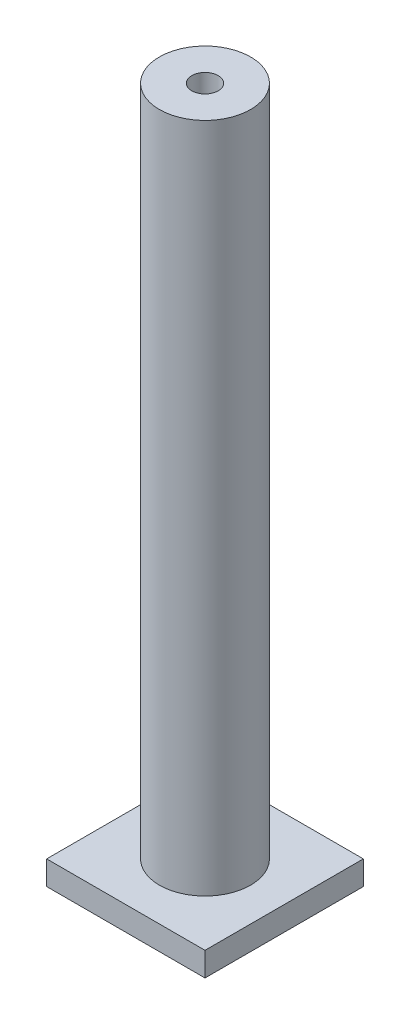
ISO-10303-21;
HEADER;
FILE_DESCRIPTION(('STEP AP214'),'2;1');
FILE_NAME('part.step','',(''),(''),'','','');
FILE_SCHEMA(('AUTOMOTIVE_DESIGN { 1 0 10303 214 1 1 1 1 }'));
ENDSEC;
DATA;
#1=APPLICATION_CONTEXT('core data for automotive mechanical design processes');
#2=APPLICATION_PROTOCOL_DEFINITION('international standard','automotive_design',2000,#1);
#3=PRODUCT_CONTEXT('',#1,'mechanical');
#4=PRODUCT('Part','Part','',(#3));
#5=PRODUCT_RELATED_PRODUCT_CATEGORY('part','',(#4));
#6=PRODUCT_DEFINITION_FORMATION('','',#4);
#7=PRODUCT_DEFINITION_CONTEXT('part definition',#1,'design');
#8=PRODUCT_DEFINITION('design','',#6,#7);
#9=PRODUCT_DEFINITION_SHAPE('','',#8);
#10=(LENGTH_UNIT() NAMED_UNIT(*) SI_UNIT(.MILLI.,.METRE.));
#11=(NAMED_UNIT(*) PLANE_ANGLE_UNIT() SI_UNIT($,.RADIAN.));
#12=(NAMED_UNIT(*) SI_UNIT($,.STERADIAN.) SOLID_ANGLE_UNIT());
#13=UNCERTAINTY_MEASURE_WITH_UNIT(LENGTH_MEASURE(1.E-05),#10,'distance_accuracy_value','');
#14=(GEOMETRIC_REPRESENTATION_CONTEXT(3) GLOBAL_UNCERTAINTY_ASSIGNED_CONTEXT((#13)) GLOBAL_UNIT_ASSIGNED_CONTEXT((#10,
#11,#12)) REPRESENTATION_CONTEXT('',''));
#15=CARTESIAN_POINT('',(0.,0.,0.));
#16=DIRECTION('',(0.,0.,1.));
#17=DIRECTION('',(1.,0.,0.));
#18=AXIS2_PLACEMENT_3D('',#15,#16,#17);
#19=CARTESIAN_POINT('',(0.,2.5,0.));
#20=DIRECTION('',(0.,1.,0.));
#21=DIRECTION('',(0.,0.,1.));
#22=AXIS2_PLACEMENT_3D('',#19,#20,#21);
#23=PLANE('',#22);
#24=DIRECTION('',(0.,0.,1.));
#25=VECTOR('',#24,1.);
#26=CARTESIAN_POINT('',(-7.79447852760735,2.5,-6.83282208588957));
#27=LINE('',#26,#25);
#28=CARTESIAN_POINT('',(-7.79447852760735,2.5,-6.83282208588957));
#29=VERTEX_POINT('',#28);
#30=CARTESIAN_POINT('',(-7.79447852760735,2.5,9.66717791411043));
#31=VERTEX_POINT('',#30);
#32=EDGE_CURVE('E87',#29,#31,#27,.T.);
#33=ORIENTED_EDGE('',*,*,#32,.T.);
#34=DIRECTION('',(1.,0.,0.));
#35=VECTOR('',#34,1.);
#36=CARTESIAN_POINT('',(-7.79447852760735,2.5,9.66717791411043));
#37=LINE('',#36,#35);
#38=CARTESIAN_POINT('',(8.70552147239265,2.5,9.66717791411043));
#39=VERTEX_POINT('',#38);
#40=EDGE_CURVE('E82',#31,#39,#37,.T.);
#41=ORIENTED_EDGE('',*,*,#40,.T.);
#42=DIRECTION('',(0.,0.,-1.));
#43=VECTOR('',#42,1.);
#44=CARTESIAN_POINT('',(8.70552147239265,2.5,-6.83282208588958));
#45=LINE('',#44,#43);
#46=CARTESIAN_POINT('',(8.70552147239265,2.5,-6.83282208588958));
#47=VERTEX_POINT('',#46);
#48=EDGE_CURVE('E85',#39,#47,#45,.T.);
#49=ORIENTED_EDGE('',*,*,#48,.T.);
#50=DIRECTION('',(-1.,0.,0.));
#51=VECTOR('',#50,1.);
#52=CARTESIAN_POINT('',(-7.79447852760735,2.5,-6.83282208588957));
#53=LINE('',#52,#51);
#54=EDGE_CURVE('E52',#47,#29,#53,.T.);
#55=ORIENTED_EDGE('',*,*,#54,.T.);
#56=EDGE_LOOP('',(#33,#41,#49,#55));
#57=FACE_BOUND('',#56,.T.);
#58=CARTESIAN_POINT('',(0.455521472392649,2.5,1.41717791411042));
#59=DIRECTION('',(0.,1.,0.));
#60=DIRECTION('',(0.,0.,1.));
#61=AXIS2_PLACEMENT_3D('',#58,#59,#60);
#62=CIRCLE('',#61,4.75);
#63=CARTESIAN_POINT('',(0.455521472392649,2.5,6.16717791411042));
#64=VERTEX_POINT('',#63);
#65=EDGE_CURVE('E117',#64,#64,#62,.T.);
#66=ORIENTED_EDGE('',*,*,#65,.F.);
#67=EDGE_LOOP('',(#66));
#68=FACE_BOUND('',#67,.T.);
#69=ADVANCED_FACE('F35',(#57,#68),#23,.T.);
#70=CARTESIAN_POINT('',(0.,0.,0.));
#71=DIRECTION('',(0.,1.,0.));
#72=DIRECTION('',(0.,0.,1.));
#73=AXIS2_PLACEMENT_3D('',#70,#71,#72);
#74=PLANE('',#73);
#75=DIRECTION('',(0.,0.,1.));
#76=VECTOR('',#75,1.);
#77=CARTESIAN_POINT('',(-7.79447852760735,0.,-6.83282208588957));
#78=LINE('',#77,#76);
#79=CARTESIAN_POINT('',(-7.79447852760735,0.,-6.83282208588957));
#80=VERTEX_POINT('',#79);
#81=CARTESIAN_POINT('',(-7.79447852760735,0.,9.66717791411043));
#82=VERTEX_POINT('',#81);
#83=EDGE_CURVE('E99',#80,#82,#78,.T.);
#84=ORIENTED_EDGE('',*,*,#83,.F.);
#85=DIRECTION('',(-1.,0.,0.));
#86=VECTOR('',#85,1.);
#87=CARTESIAN_POINT('',(-7.79447852760735,0.,-6.83282208588957));
#88=LINE('',#87,#86);
#89=CARTESIAN_POINT('',(8.70552147239265,0.,-6.83282208588958));
#90=VERTEX_POINT('',#89);
#91=EDGE_CURVE('E75',#90,#80,#88,.T.);
#92=ORIENTED_EDGE('',*,*,#91,.F.);
#93=DIRECTION('',(0.,0.,-1.));
#94=VECTOR('',#93,1.);
#95=CARTESIAN_POINT('',(8.70552147239265,0.,-6.83282208588958));
#96=LINE('',#95,#94);
#97=CARTESIAN_POINT('',(8.70552147239265,0.,9.66717791411043));
#98=VERTEX_POINT('',#97);
#99=EDGE_CURVE('E69',#98,#90,#96,.T.);
#100=ORIENTED_EDGE('',*,*,#99,.F.);
#101=DIRECTION('',(1.,0.,0.));
#102=VECTOR('',#101,1.);
#103=CARTESIAN_POINT('',(-7.79447852760735,0.,9.66717791411043));
#104=LINE('',#103,#102);
#105=EDGE_CURVE('E91',#82,#98,#104,.T.);
#106=ORIENTED_EDGE('',*,*,#105,.F.);
#107=EDGE_LOOP('',(#84,#92,#100,#106));
#108=FACE_BOUND('',#107,.T.);
#109=CARTESIAN_POINT('',(0.455521472392649,0.,1.41717791411042));
#110=DIRECTION('',(0.,1.,0.));
#111=DIRECTION('',(0.,0.,1.));
#112=AXIS2_PLACEMENT_3D('',#109,#110,#111);
#113=CIRCLE('',#112,1.375);
#114=CARTESIAN_POINT('',(0.455521472392649,0.,2.79217791411042));
#115=VERTEX_POINT('',#114);
#116=EDGE_CURVE('E102',#115,#115,#113,.T.);
#117=ORIENTED_EDGE('',*,*,#116,.T.);
#118=EDGE_LOOP('',(#117));
#119=FACE_BOUND('',#118,.T.);
#120=ADVANCED_FACE('F110',(#108,#119),#74,.F.);
#121=CARTESIAN_POINT('',(-7.79447852760735,2.5,-6.83282208588957));
#122=DIRECTION('',(1.,0.,0.));
#123=DIRECTION('',(0.,0.,-1.));
#124=AXIS2_PLACEMENT_3D('',#121,#122,#123);
#125=PLANE('',#124);
#126=ORIENTED_EDGE('',*,*,#83,.T.);
#127=DIRECTION('',(0.,-1.,0.));
#128=VECTOR('',#127,1.);
#129=CARTESIAN_POINT('',(-7.79447852760735,2.5,9.66717791411043));
#130=LINE('',#129,#128);
#131=EDGE_CURVE('E11',#31,#82,#130,.T.);
#132=ORIENTED_EDGE('',*,*,#131,.F.);
#133=ORIENTED_EDGE('',*,*,#32,.F.);
#134=DIRECTION('',(0.,-1.,0.));
#135=VECTOR('',#134,1.);
#136=CARTESIAN_POINT('',(-7.79447852760735,2.5,-6.83282208588957));
#137=LINE('',#136,#135);
#138=EDGE_CURVE('E95',#29,#80,#137,.T.);
#139=ORIENTED_EDGE('',*,*,#138,.T.);
#140=EDGE_LOOP('',(#126,#132,#133,#139));
#141=FACE_BOUND('',#140,.T.);
#142=ADVANCED_FACE('F37',(#141),#125,.F.);
#143=CARTESIAN_POINT('',(-7.79447852760735,2.5,9.66717791411043));
#144=DIRECTION('',(0.,0.,-1.));
#145=DIRECTION('',(-1.,0.,0.));
#146=AXIS2_PLACEMENT_3D('',#143,#144,#145);
#147=PLANE('',#146);
#148=ORIENTED_EDGE('',*,*,#105,.T.);
#149=DIRECTION('',(0.,-1.,0.));
#150=VECTOR('',#149,1.);
#151=CARTESIAN_POINT('',(8.70552147239265,2.5,9.66717791411043));
#152=LINE('',#151,#150);
#153=EDGE_CURVE('E44',#39,#98,#152,.T.);
#154=ORIENTED_EDGE('',*,*,#153,.F.);
#155=ORIENTED_EDGE('',*,*,#40,.F.);
#156=ORIENTED_EDGE('',*,*,#131,.T.);
#157=EDGE_LOOP('',(#148,#154,#155,#156));
#158=FACE_BOUND('',#157,.T.);
#159=ADVANCED_FACE('F90',(#158),#147,.F.);
#160=CARTESIAN_POINT('',(8.70552147239265,2.5,-6.83282208588958));
#161=DIRECTION('',(-1.,0.,0.));
#162=DIRECTION('',(0.,0.,1.));
#163=AXIS2_PLACEMENT_3D('',#160,#161,#162);
#164=PLANE('',#163);
#165=ORIENTED_EDGE('',*,*,#99,.T.);
#166=DIRECTION('',(0.,-1.,0.));
#167=VECTOR('',#166,1.);
#168=CARTESIAN_POINT('',(8.70552147239265,2.5,-6.83282208588958));
#169=LINE('',#168,#167);
#170=EDGE_CURVE('E92',#47,#90,#169,.T.);
#171=ORIENTED_EDGE('',*,*,#170,.F.);
#172=ORIENTED_EDGE('',*,*,#48,.F.);
#173=ORIENTED_EDGE('',*,*,#153,.T.);
#174=EDGE_LOOP('',(#165,#171,#172,#173));
#175=FACE_BOUND('',#174,.T.);
#176=ADVANCED_FACE('F93',(#175),#164,.F.);
#177=CARTESIAN_POINT('',(-7.79447852760735,2.5,-6.83282208588957));
#178=DIRECTION('',(0.,0.,1.));
#179=DIRECTION('',(1.,0.,0.));
#180=AXIS2_PLACEMENT_3D('',#177,#178,#179);
#181=PLANE('',#180);
#182=ORIENTED_EDGE('',*,*,#91,.T.);
#183=ORIENTED_EDGE('',*,*,#138,.F.);
#184=ORIENTED_EDGE('',*,*,#54,.F.);
#185=ORIENTED_EDGE('',*,*,#170,.T.);
#186=EDGE_LOOP('',(#182,#183,#184,#185));
#187=FACE_BOUND('',#186,.T.);
#188=ADVANCED_FACE('F107',(#187),#181,.F.);
#189=CARTESIAN_POINT('',(0.455521472392649,2.5,1.41717791411042));
#190=DIRECTION('',(0.,-1.,0.));
#191=DIRECTION('',(0.,0.,-1.));
#192=AXIS2_PLACEMENT_3D('',#189,#190,#191);
#193=CYLINDRICAL_SURFACE('',#192,1.375);
#194=ORIENTED_EDGE('',*,*,#116,.F.);
#195=EDGE_LOOP('',(#194));
#196=FACE_BOUND('',#195,.T.);
#197=CARTESIAN_POINT('',(0.455521472392649,72.5,1.41717791411042));
#198=DIRECTION('',(0.,1.,0.));
#199=DIRECTION('',(0.,0.,1.));
#200=AXIS2_PLACEMENT_3D('',#197,#198,#199);
#201=CIRCLE('',#200,1.375);
#202=CARTESIAN_POINT('',(0.455521472392649,72.5,2.79217791411042));
#203=VERTEX_POINT('',#202);
#204=EDGE_CURVE('E120',#203,#203,#201,.T.);
#205=ORIENTED_EDGE('',*,*,#204,.T.);
#206=EDGE_LOOP('',(#205));
#207=FACE_BOUND('',#206,.T.);
#208=ADVANCED_FACE('F126',(#196,#207),#193,.F.);
#209=CARTESIAN_POINT('',(0.455521472392649,72.5,1.41717791411042));
#210=DIRECTION('',(0.,1.,0.));
#211=DIRECTION('',(0.,0.,1.));
#212=AXIS2_PLACEMENT_3D('',#209,#210,#211);
#213=PLANE('',#212);
#214=CARTESIAN_POINT('',(0.455521472392649,72.5,1.41717791411042));
#215=DIRECTION('',(0.,1.,0.));
#216=DIRECTION('',(0.,0.,1.));
#217=AXIS2_PLACEMENT_3D('',#214,#215,#216);
#218=CIRCLE('',#217,4.75);
#219=CARTESIAN_POINT('',(0.455521472392649,72.5,6.16717791411042));
#220=VERTEX_POINT('',#219);
#221=EDGE_CURVE('E116',#220,#220,#218,.T.);
#222=ORIENTED_EDGE('',*,*,#221,.T.);
#223=EDGE_LOOP('',(#222));
#224=FACE_BOUND('',#223,.T.);
#225=ORIENTED_EDGE('',*,*,#204,.F.);
#226=EDGE_LOOP('',(#225));
#227=FACE_BOUND('',#226,.T.);
#228=ADVANCED_FACE('F128',(#224,#227),#213,.T.);
#229=CARTESIAN_POINT('',(0.455521472392649,72.5,1.41717791411042));
#230=DIRECTION('',(0.,-1.,0.));
#231=DIRECTION('',(0.,0.,-1.));
#232=AXIS2_PLACEMENT_3D('',#229,#230,#231);
#233=CYLINDRICAL_SURFACE('',#232,4.75);
#234=ORIENTED_EDGE('',*,*,#221,.F.);
#235=EDGE_LOOP('',(#234));
#236=FACE_BOUND('',#235,.T.);
#237=ORIENTED_EDGE('',*,*,#65,.T.);
#238=EDGE_LOOP('',(#237));
#239=FACE_BOUND('',#238,.T.);
#240=ADVANCED_FACE('F130',(#236,#239),#233,.T.);
#241=CLOSED_SHELL('',(#69,#120,#142,#159,#176,#188,#208,#228,#240));
#242=MANIFOLD_SOLID_BREP('B2',#241);
#243=ADVANCED_BREP_SHAPE_REPRESENTATION('',(#18,#242),#14);
#244=SHAPE_DEFINITION_REPRESENTATION(#9,#243);
ENDSEC;
END-ISO-10303-21;
